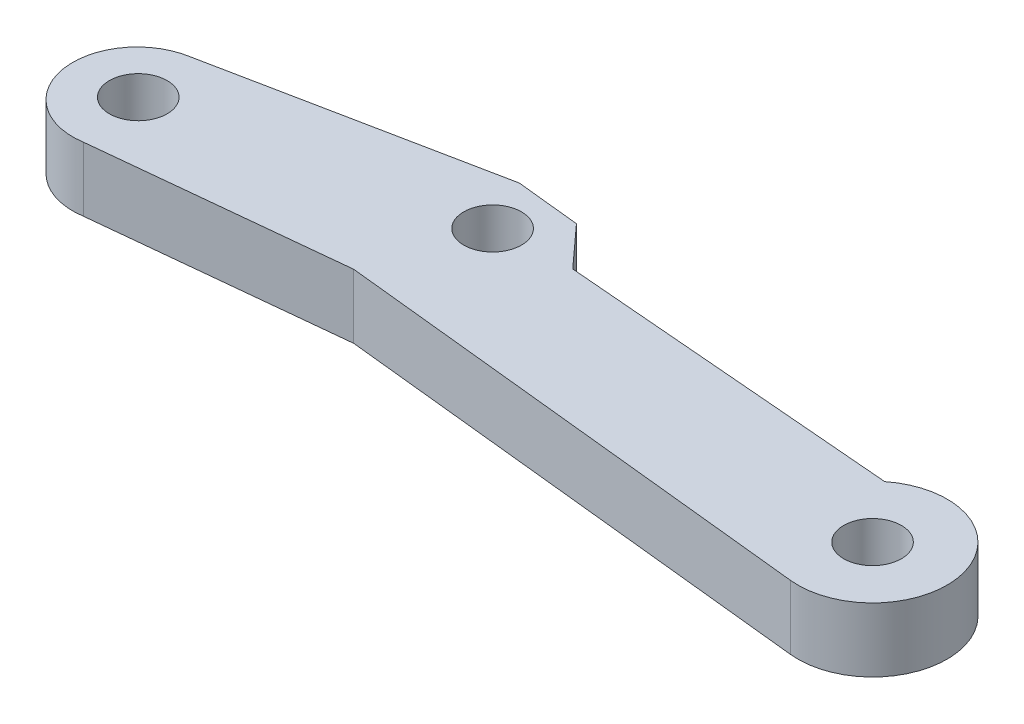
ISO-10303-21;
HEADER;
FILE_DESCRIPTION(('STEP AP214'),'2;1');
FILE_NAME('part.step','',(''),(''),'','','');
FILE_SCHEMA(('AUTOMOTIVE_DESIGN { 1 0 10303 214 1 1 1 1 }'));
ENDSEC;
DATA;
#1=APPLICATION_CONTEXT('core data for automotive mechanical design processes');
#2=APPLICATION_PROTOCOL_DEFINITION('international standard','automotive_design',2000,#1);
#3=PRODUCT_CONTEXT('',#1,'mechanical');
#4=PRODUCT('Part','Part','',(#3));
#5=PRODUCT_RELATED_PRODUCT_CATEGORY('part','',(#4));
#6=PRODUCT_DEFINITION_FORMATION('','',#4);
#7=PRODUCT_DEFINITION_CONTEXT('part definition',#1,'design');
#8=PRODUCT_DEFINITION('design','',#6,#7);
#9=PRODUCT_DEFINITION_SHAPE('','',#8);
#10=(LENGTH_UNIT() NAMED_UNIT(*) SI_UNIT(.MILLI.,.METRE.));
#11=(NAMED_UNIT(*) PLANE_ANGLE_UNIT() SI_UNIT($,.RADIAN.));
#12=(NAMED_UNIT(*) SI_UNIT($,.STERADIAN.) SOLID_ANGLE_UNIT());
#13=UNCERTAINTY_MEASURE_WITH_UNIT(LENGTH_MEASURE(1.E-05),#10,'distance_accuracy_value','');
#14=(GEOMETRIC_REPRESENTATION_CONTEXT(3) GLOBAL_UNCERTAINTY_ASSIGNED_CONTEXT((#13)) GLOBAL_UNIT_ASSIGNED_CONTEXT((#10,
#11,#12)) REPRESENTATION_CONTEXT('',''));
#15=CARTESIAN_POINT('',(0.,0.,0.));
#16=DIRECTION('',(0.,0.,1.));
#17=DIRECTION('',(1.,0.,0.));
#18=AXIS2_PLACEMENT_3D('',#15,#16,#17);
#19=CARTESIAN_POINT('',(22.2994058375288,-68.,33.5249544921954));
#20=DIRECTION('',(-0.19761330757037,0.,-0.980280052164226));
#21=DIRECTION('',(-0.980280052164226,0.,0.19761330757037));
#22=AXIS2_PLACEMENT_3D('',#19,#20,#21);
#23=PLANE('',#22);
#24=DIRECTION('',(0.980280052164226,0.,-0.19761330757037));
#25=VECTOR('',#24,1.);
#26=CARTESIAN_POINT('',(22.2994058375288,-68.,33.5249544921954));
#27=LINE('',#26,#25);
#28=CARTESIAN_POINT('',(22.2994058375288,-68.,33.5249544921954));
#29=VERTEX_POINT('',#28);
#30=CARTESIAN_POINT('',(43.6041069864173,-68.,29.2301690872132));
#31=VERTEX_POINT('',#30);
#32=EDGE_CURVE('E111',#29,#31,#27,.T.);
#33=ORIENTED_EDGE('',*,*,#32,.T.);
#34=DIRECTION('',(0.,-1.,0.));
#35=VECTOR('',#34,1.);
#36=CARTESIAN_POINT('',(43.6041069864173,-68.,29.2301690872132));
#37=LINE('',#36,#35);
#38=CARTESIAN_POINT('',(43.6041069864173,-73.,29.2301690872132));
#39=VERTEX_POINT('',#38);
#40=EDGE_CURVE('E172',#31,#39,#37,.T.);
#41=ORIENTED_EDGE('',*,*,#40,.T.);
#42=DIRECTION('',(0.980280052164226,0.,-0.19761330757037));
#43=VECTOR('',#42,1.);
#44=CARTESIAN_POINT('',(22.2994058375288,-73.,33.5249544921954));
#45=LINE('',#44,#43);
#46=CARTESIAN_POINT('',(22.2994058375288,-73.,33.5249544921954));
#47=VERTEX_POINT('',#46);
#48=EDGE_CURVE('E144',#47,#39,#45,.T.);
#49=ORIENTED_EDGE('',*,*,#48,.F.);
#50=DIRECTION('',(0.,-1.,0.));
#51=VECTOR('',#50,1.);
#52=CARTESIAN_POINT('',(22.2994058375288,-68.,33.5249544921954));
#53=LINE('',#52,#51);
#54=EDGE_CURVE('E169',#29,#47,#53,.T.);
#55=ORIENTED_EDGE('',*,*,#54,.F.);
#56=EDGE_LOOP('',(#33,#41,#49,#55));
#57=FACE_BOUND('',#56,.T.);
#58=ADVANCED_FACE('F38',(#57),#23,.T.);
#59=CARTESIAN_POINT('',(23.0883515015579,-68.,38.4893621480176));
#60=DIRECTION('',(0.,-1.,0.));
#61=DIRECTION('',(0.,0.,-1.));
#62=AXIS2_PLACEMENT_3D('',#59,#60,#61);
#63=CYLINDRICAL_SURFACE('',#62,5.02670653947264);
#64=CARTESIAN_POINT('',(23.0883515015579,-73.,38.4893621480176));
#65=DIRECTION('',(0.,-1.,0.));
#66=DIRECTION('',(0.,0.,-1.));
#67=AXIS2_PLACEMENT_3D('',#64,#65,#66);
#68=CIRCLE('',#67,5.02670653947264);
#69=CARTESIAN_POINT('',(23.8772971655872,-73.,43.4537698038399));
#70=VERTEX_POINT('',#69);
#71=EDGE_CURVE('E165',#70,#47,#68,.T.);
#72=ORIENTED_EDGE('',*,*,#71,.F.);
#73=DIRECTION('',(0.,-1.,0.));
#74=VECTOR('',#73,1.);
#75=CARTESIAN_POINT('',(23.8772971655872,-68.,43.4537698038399));
#76=LINE('',#75,#74);
#77=CARTESIAN_POINT('',(23.8772971655872,-68.,43.4537698038399));
#78=VERTEX_POINT('',#77);
#79=EDGE_CURVE('E173',#78,#70,#76,.T.);
#80=ORIENTED_EDGE('',*,*,#79,.F.);
#81=CARTESIAN_POINT('',(23.0883515015579,-68.,38.4893621480176));
#82=DIRECTION('',(0.,-1.,0.));
#83=DIRECTION('',(0.,0.,-1.));
#84=AXIS2_PLACEMENT_3D('',#81,#82,#83);
#85=CIRCLE('',#84,5.02670653947264);
#86=EDGE_CURVE('E120',#78,#29,#85,.T.);
#87=ORIENTED_EDGE('',*,*,#86,.T.);
#88=ORIENTED_EDGE('',*,*,#54,.T.);
#89=EDGE_LOOP('',(#72,#80,#87,#88));
#90=FACE_BOUND('',#89,.T.);
#91=ADVANCED_FACE('F200',(#90),#63,.T.);
#92=CARTESIAN_POINT('',(42.9663306655025,-68.,41.5017314355385));
#93=DIRECTION('',(0.10172916558817,0.,0.994812131444292));
#94=DIRECTION('',(0.994812131444292,0.,-0.10172916558817));
#95=AXIS2_PLACEMENT_3D('',#92,#93,#94);
#96=PLANE('',#95);
#97=DIRECTION('',(-0.994812131444292,0.,0.10172916558817));
#98=VECTOR('',#97,1.);
#99=CARTESIAN_POINT('',(42.9663306655025,-73.,41.5017314355385));
#100=LINE('',#99,#98);
#101=CARTESIAN_POINT('',(42.9663306655025,-73.,41.5017314355385));
#102=VERTEX_POINT('',#101);
#103=EDGE_CURVE('E161',#102,#70,#100,.T.);
#104=ORIENTED_EDGE('',*,*,#103,.F.);
#105=DIRECTION('',(0.,-1.,0.));
#106=VECTOR('',#105,1.);
#107=CARTESIAN_POINT('',(42.9663306655025,-68.,41.5017314355385));
#108=LINE('',#107,#106);
#109=CARTESIAN_POINT('',(42.9663306655025,-68.,41.5017314355385));
#110=VERTEX_POINT('',#109);
#111=EDGE_CURVE('E176',#110,#102,#108,.T.);
#112=ORIENTED_EDGE('',*,*,#111,.F.);
#113=DIRECTION('',(-0.994812131444292,0.,0.10172916558817));
#114=VECTOR('',#113,1.);
#115=CARTESIAN_POINT('',(42.9663306655025,-68.,41.5017314355385));
#116=LINE('',#115,#114);
#117=EDGE_CURVE('E137',#110,#78,#116,.T.);
#118=ORIENTED_EDGE('',*,*,#117,.T.);
#119=ORIENTED_EDGE('',*,*,#79,.T.);
#120=EDGE_LOOP('',(#104,#112,#118,#119));
#121=FACE_BOUND('',#120,.T.);
#122=ADVANCED_FACE('F243',(#121),#96,.T.);
#123=CARTESIAN_POINT('',(80.9887124146183,-68.,45.4779480814177));
#124=DIRECTION('',(-0.104008509836308,0.,0.99457640726172));
#125=DIRECTION('',(0.99457640726172,0.,0.104008509836308));
#126=AXIS2_PLACEMENT_3D('',#123,#124,#125);
#127=PLANE('',#126);
#128=DIRECTION('',(-0.99457640726172,0.,-0.104008509836308));
#129=VECTOR('',#128,1.);
#130=CARTESIAN_POINT('',(80.9887124146183,-73.,45.4779480814177));
#131=LINE('',#130,#129);
#132=CARTESIAN_POINT('',(80.9887124146183,-73.,45.4779480814177));
#133=VERTEX_POINT('',#132);
#134=EDGE_CURVE('E157',#133,#102,#131,.T.);
#135=ORIENTED_EDGE('',*,*,#134,.F.);
#136=DIRECTION('',(0.,-1.,0.));
#137=VECTOR('',#136,1.);
#138=CARTESIAN_POINT('',(80.9887124146183,-68.,45.4779480814177));
#139=LINE('',#138,#137);
#140=CARTESIAN_POINT('',(80.9887124146183,-68.,45.4779480814177));
#141=VERTEX_POINT('',#140);
#142=EDGE_CURVE('E179',#141,#133,#139,.T.);
#143=ORIENTED_EDGE('',*,*,#142,.F.);
#144=DIRECTION('',(-0.99457640726172,0.,-0.104008509836308));
#145=VECTOR('',#144,1.);
#146=CARTESIAN_POINT('',(80.9887124146183,-68.,45.4779480814177));
#147=LINE('',#146,#145);
#148=EDGE_CURVE('E130',#141,#110,#147,.T.);
#149=ORIENTED_EDGE('',*,*,#148,.T.);
#150=ORIENTED_EDGE('',*,*,#111,.T.);
#151=EDGE_LOOP('',(#135,#143,#149,#150));
#152=FACE_BOUND('',#151,.T.);
#153=ADVANCED_FACE('F253',(#152),#127,.T.);
#154=CARTESIAN_POINT('',(81.5930942183607,-68.,39.6985759519024));
#155=DIRECTION('',(0.,-1.,0.));
#156=DIRECTION('',(0.,0.,-1.));
#157=AXIS2_PLACEMENT_3D('',#154,#155,#156);
#158=CYLINDRICAL_SURFACE('',#157,5.81088801958118);
#159=CARTESIAN_POINT('',(81.5930942183607,-73.,39.6985759519024));
#160=DIRECTION('',(0.,-1.,0.));
#161=DIRECTION('',(0.,0.,1.));
#162=AXIS2_PLACEMENT_3D('',#159,#160,#161);
#163=CIRCLE('',#162,5.81088801958118);
#164=CARTESIAN_POINT('',(77.9854924947194,-73.,35.143180318185));
#165=VERTEX_POINT('',#164);
#166=EDGE_CURVE('E153',#165,#133,#163,.T.);
#167=ORIENTED_EDGE('',*,*,#166,.F.);
#168=DIRECTION('',(0.,-1.,0.));
#169=VECTOR('',#168,1.);
#170=CARTESIAN_POINT('',(77.9854924947194,-68.,35.143180318185));
#171=LINE('',#170,#169);
#172=CARTESIAN_POINT('',(77.9854924947194,-68.,35.143180318185));
#173=VERTEX_POINT('',#172);
#174=EDGE_CURVE('E119',#173,#165,#171,.T.);
#175=ORIENTED_EDGE('',*,*,#174,.F.);
#176=CARTESIAN_POINT('',(81.5930942183607,-68.,39.6985759519024));
#177=DIRECTION('',(0.,-1.,0.));
#178=DIRECTION('',(0.,0.,1.));
#179=AXIS2_PLACEMENT_3D('',#176,#177,#178);
#180=CIRCLE('',#179,5.81088801958118);
#181=EDGE_CURVE('E126',#173,#141,#180,.T.);
#182=ORIENTED_EDGE('',*,*,#181,.T.);
#183=ORIENTED_EDGE('',*,*,#142,.T.);
#184=EDGE_LOOP('',(#167,#175,#182,#183));
#185=FACE_BOUND('',#184,.T.);
#186=ADVANCED_FACE('F250',(#185),#158,.T.);
#187=CARTESIAN_POINT('',(51.4864477873886,-68.,32.9522500136108));
#188=DIRECTION('',(0.082398441042192,0.,-0.996599466643353));
#189=DIRECTION('',(-0.996599466643353,0.,-0.082398441042192));
#190=AXIS2_PLACEMENT_3D('',#187,#188,#189);
#191=PLANE('',#190);
#192=DIRECTION('',(0.996599466643353,0.,0.082398441042192));
#193=VECTOR('',#192,1.);
#194=CARTESIAN_POINT('',(51.4864477873886,-73.,32.9522500136108));
#195=LINE('',#194,#193);
#196=CARTESIAN_POINT('',(51.4864477873886,-73.,32.9522500136108));
#197=VERTEX_POINT('',#196);
#198=EDGE_CURVE('E117',#197,#165,#195,.T.);
#199=ORIENTED_EDGE('',*,*,#198,.F.);
#200=DIRECTION('',(0.,-1.,0.));
#201=VECTOR('',#200,1.);
#202=CARTESIAN_POINT('',(51.4864477873886,-68.,32.9522500136108));
#203=LINE('',#202,#201);
#204=CARTESIAN_POINT('',(51.4864477873886,-68.,32.9522500136108));
#205=VERTEX_POINT('',#204);
#206=EDGE_CURVE('E104',#205,#197,#203,.T.);
#207=ORIENTED_EDGE('',*,*,#206,.F.);
#208=DIRECTION('',(0.996599466643353,0.,0.082398441042192));
#209=VECTOR('',#208,1.);
#210=CARTESIAN_POINT('',(51.4864477873886,-68.,32.9522500136108));
#211=LINE('',#210,#209);
#212=EDGE_CURVE('E110',#205,#173,#211,.T.);
#213=ORIENTED_EDGE('',*,*,#212,.T.);
#214=ORIENTED_EDGE('',*,*,#174,.T.);
#215=EDGE_LOOP('',(#199,#207,#213,#214));
#216=FACE_BOUND('',#215,.T.);
#217=ADVANCED_FACE('F115',(#216),#191,.T.);
#218=CARTESIAN_POINT('',(47.401706558374,-68.,28.4646162122104));
#219=DIRECTION('',(0.739523736349641,0.,-0.673130480200879));
#220=DIRECTION('',(-0.673130480200879,0.,-0.739523736349641));
#221=AXIS2_PLACEMENT_3D('',#218,#219,#220);
#222=PLANE('',#221);
#223=DIRECTION('',(0.673130480200879,0.,0.739523736349641));
#224=VECTOR('',#223,1.);
#225=CARTESIAN_POINT('',(47.401706558374,-73.,28.4646162122104));
#226=LINE('',#225,#224);
#227=CARTESIAN_POINT('',(48.5713461575372,-73.,29.749621529898));
#228=VERTEX_POINT('',#227);
#229=EDGE_CURVE('E147',#228,#197,#226,.T.);
#230=ORIENTED_EDGE('',*,*,#229,.F.);
#231=DIRECTION('',(0.,1.,0.));
#232=VECTOR('',#231,1.);
#233=CARTESIAN_POINT('',(48.5713461575372,-68.,29.749621529898));
#234=LINE('',#233,#232);
#235=CARTESIAN_POINT('',(48.5713461575372,-68.,29.749621529898));
#236=VERTEX_POINT('',#235);
#237=EDGE_CURVE('E48',#228,#236,#234,.T.);
#238=ORIENTED_EDGE('',*,*,#237,.T.);
#239=DIRECTION('',(0.673130480200879,0.,0.739523736349641));
#240=VECTOR('',#239,1.);
#241=CARTESIAN_POINT('',(47.401706558374,-68.,28.4646162122104));
#242=LINE('',#241,#240);
#243=EDGE_CURVE('E101',#236,#205,#242,.T.);
#244=ORIENTED_EDGE('',*,*,#243,.T.);
#245=ORIENTED_EDGE('',*,*,#206,.T.);
#246=EDGE_LOOP('',(#230,#238,#244,#245));
#247=FACE_BOUND('',#246,.T.);
#248=ADVANCED_FACE('F103',(#247),#222,.T.);
#249=CARTESIAN_POINT('',(81.5930942183607,-68.,39.6985759519024));
#250=DIRECTION('',(0.,1.,0.));
#251=DIRECTION('',(0.,0.,1.));
#252=AXIS2_PLACEMENT_3D('',#249,#250,#251);
#253=PLANE('',#252);
#254=CARTESIAN_POINT('',(81.5930942183607,-68.,39.6985759519024));
#255=DIRECTION('',(0.,1.,0.));
#256=DIRECTION('',(0.,0.,1.));
#257=AXIS2_PLACEMENT_3D('',#254,#255,#256);
#258=CIRCLE('',#257,2.25);
#259=CARTESIAN_POINT('',(81.5930942183607,-68.,41.9485759519024));
#260=VERTEX_POINT('',#259);
#261=EDGE_CURVE('E220',#260,#260,#258,.T.);
#262=ORIENTED_EDGE('',*,*,#261,.F.);
#263=EDGE_LOOP('',(#262));
#264=FACE_BOUND('',#263,.T.);
#265=CARTESIAN_POINT('',(22.9656847085218,-68.,38.2848708650265));
#266=DIRECTION('',(0.,-1.,0.));
#267=DIRECTION('',(0.,0.,-1.));
#268=AXIS2_PLACEMENT_3D('',#265,#266,#267);
#269=CIRCLE('',#268,2.25);
#270=CARTESIAN_POINT('',(22.9656847085218,-68.,36.0348708650265));
#271=VERTEX_POINT('',#270);
#272=EDGE_CURVE('E212',#271,#271,#269,.T.);
#273=ORIENTED_EDGE('',*,*,#272,.T.);
#274=EDGE_LOOP('',(#273));
#275=FACE_BOUND('',#274,.T.);
#276=CARTESIAN_POINT('',(45.6292596156505,-68.,33.3388695196497));
#277=DIRECTION('',(0.,-1.,0.));
#278=DIRECTION('',(0.,0.,-1.));
#279=AXIS2_PLACEMENT_3D('',#276,#277,#278);
#280=CIRCLE('',#279,2.25);
#281=CARTESIAN_POINT('',(45.6292596156505,-68.,31.0888695196497));
#282=VERTEX_POINT('',#281);
#283=EDGE_CURVE('E148',#282,#282,#280,.T.);
#284=ORIENTED_EDGE('',*,*,#283,.T.);
#285=EDGE_LOOP('',(#284));
#286=FACE_BOUND('',#285,.T.);
#287=ORIENTED_EDGE('',*,*,#243,.F.);
#288=DIRECTION('',(0.99457640726172,0.,0.104008509836309));
#289=VECTOR('',#288,1.);
#290=CARTESIAN_POINT('',(82.2650362596076,-68.,33.2731622783169));
#291=LINE('',#290,#289);
#292=EDGE_CURVE('E11',#236,#31,#291,.F.);
#293=ORIENTED_EDGE('',*,*,#292,.T.);
#294=ORIENTED_EDGE('',*,*,#32,.F.);
#295=ORIENTED_EDGE('',*,*,#86,.F.);
#296=ORIENTED_EDGE('',*,*,#117,.F.);
#297=ORIENTED_EDGE('',*,*,#148,.F.);
#298=ORIENTED_EDGE('',*,*,#181,.F.);
#299=ORIENTED_EDGE('',*,*,#212,.F.);
#300=EDGE_LOOP('',(#287,#293,#294,#295,#296,#297,#298,#299));
#301=FACE_BOUND('',#300,.T.);
#302=ADVANCED_FACE('F123',(#264,#275,#286,#301),#253,.T.);
#303=CARTESIAN_POINT('',(81.5930942183607,-73.,39.6985759519024));
#304=DIRECTION('',(0.,1.,0.));
#305=DIRECTION('',(0.,0.,1.));
#306=AXIS2_PLACEMENT_3D('',#303,#304,#305);
#307=PLANE('',#306);
#308=CARTESIAN_POINT('',(81.5930942183607,-73.,39.6985759519024));
#309=DIRECTION('',(0.,1.,0.));
#310=DIRECTION('',(0.,0.,1.));
#311=AXIS2_PLACEMENT_3D('',#308,#309,#310);
#312=CIRCLE('',#311,2.25);
#313=CARTESIAN_POINT('',(81.5930942183607,-73.,41.9485759519024));
#314=VERTEX_POINT('',#313);
#315=EDGE_CURVE('E42',#314,#314,#312,.T.);
#316=ORIENTED_EDGE('',*,*,#315,.T.);
#317=EDGE_LOOP('',(#316));
#318=FACE_BOUND('',#317,.T.);
#319=CARTESIAN_POINT('',(22.9656847085218,-73.,38.2848708650265));
#320=DIRECTION('',(0.,-1.,0.));
#321=DIRECTION('',(0.,0.,-1.));
#322=AXIS2_PLACEMENT_3D('',#319,#320,#321);
#323=CIRCLE('',#322,2.25);
#324=CARTESIAN_POINT('',(22.9656847085218,-73.,36.0348708650265));
#325=VERTEX_POINT('',#324);
#326=EDGE_CURVE('E216',#325,#325,#323,.T.);
#327=ORIENTED_EDGE('',*,*,#326,.F.);
#328=EDGE_LOOP('',(#327));
#329=FACE_BOUND('',#328,.T.);
#330=CARTESIAN_POINT('',(45.6292596156505,-73.,33.3388695196497));
#331=DIRECTION('',(0.,-1.,0.));
#332=DIRECTION('',(0.,0.,-1.));
#333=AXIS2_PLACEMENT_3D('',#330,#331,#332);
#334=CIRCLE('',#333,2.25);
#335=CARTESIAN_POINT('',(45.6292596156505,-73.,31.0888695196497));
#336=VERTEX_POINT('',#335);
#337=EDGE_CURVE('E208',#336,#336,#334,.T.);
#338=ORIENTED_EDGE('',*,*,#337,.F.);
#339=EDGE_LOOP('',(#338));
#340=FACE_BOUND('',#339,.T.);
#341=ORIENTED_EDGE('',*,*,#48,.T.);
#342=DIRECTION('',(-0.99457640726172,0.,-0.104008509836309));
#343=VECTOR('',#342,1.);
#344=CARTESIAN_POINT('',(43.6041069864173,-73.,29.2301690872132));
#345=LINE('',#344,#343);
#346=EDGE_CURVE('E62',#39,#228,#345,.F.);
#347=ORIENTED_EDGE('',*,*,#346,.T.);
#348=ORIENTED_EDGE('',*,*,#229,.T.);
#349=ORIENTED_EDGE('',*,*,#198,.T.);
#350=ORIENTED_EDGE('',*,*,#166,.T.);
#351=ORIENTED_EDGE('',*,*,#134,.T.);
#352=ORIENTED_EDGE('',*,*,#103,.T.);
#353=ORIENTED_EDGE('',*,*,#71,.T.);
#354=EDGE_LOOP('',(#341,#347,#348,#349,#350,#351,#352,#353));
#355=FACE_BOUND('',#354,.T.);
#356=ADVANCED_FACE('F196',(#318,#329,#340,#355),#307,.F.);
#357=CARTESIAN_POINT('',(45.6292596156505,-73.,33.3388695196497));
#358=DIRECTION('',(0.,-1.,0.));
#359=DIRECTION('',(0.,0.,-1.));
#360=AXIS2_PLACEMENT_3D('',#357,#358,#359);
#361=CYLINDRICAL_SURFACE('',#360,2.25);
#362=ORIENTED_EDGE('',*,*,#283,.F.);
#363=EDGE_LOOP('',(#362));
#364=FACE_BOUND('',#363,.T.);
#365=ORIENTED_EDGE('',*,*,#337,.T.);
#366=EDGE_LOOP('',(#365));
#367=FACE_BOUND('',#366,.T.);
#368=ADVANCED_FACE('F263',(#364,#367),#361,.F.);
#369=CARTESIAN_POINT('',(22.9656847085218,-73.,38.2848708650265));
#370=DIRECTION('',(0.,-1.,0.));
#371=DIRECTION('',(0.,0.,-1.));
#372=AXIS2_PLACEMENT_3D('',#369,#370,#371);
#373=CYLINDRICAL_SURFACE('',#372,2.25);
#374=ORIENTED_EDGE('',*,*,#272,.F.);
#375=EDGE_LOOP('',(#374));
#376=FACE_BOUND('',#375,.T.);
#377=ORIENTED_EDGE('',*,*,#326,.T.);
#378=EDGE_LOOP('',(#377));
#379=FACE_BOUND('',#378,.T.);
#380=ADVANCED_FACE('F237',(#376,#379),#373,.F.);
#381=CARTESIAN_POINT('',(43.6041069864173,-68.,29.2301690872132));
#382=DIRECTION('',(-0.104008509836309,0.,0.99457640726172));
#383=DIRECTION('',(0.,-1.,0.));
#384=AXIS2_PLACEMENT_3D('',#381,#382,#383);
#385=PLANE('',#384);
#386=ORIENTED_EDGE('',*,*,#292,.F.);
#387=ORIENTED_EDGE('',*,*,#237,.F.);
#388=ORIENTED_EDGE('',*,*,#346,.F.);
#389=ORIENTED_EDGE('',*,*,#40,.F.);
#390=EDGE_LOOP('',(#386,#387,#388,#389));
#391=FACE_BOUND('',#390,.T.);
#392=ADVANCED_FACE('F40',(#391),#385,.F.);
#393=CARTESIAN_POINT('',(81.5930942183607,-78.,39.6985759519024));
#394=DIRECTION('',(0.,1.,0.));
#395=DIRECTION('',(0.,0.,1.));
#396=AXIS2_PLACEMENT_3D('',#393,#394,#395);
#397=CYLINDRICAL_SURFACE('',#396,2.25);
#398=ORIENTED_EDGE('',*,*,#261,.T.);
#399=EDGE_LOOP('',(#398));
#400=FACE_BOUND('',#399,.T.);
#401=ORIENTED_EDGE('',*,*,#315,.F.);
#402=EDGE_LOOP('',(#401));
#403=FACE_BOUND('',#402,.T.);
#404=ADVANCED_FACE('F231',(#400,#403),#397,.F.);
#405=CLOSED_SHELL('',(#58,#91,#122,#153,#186,#217,#248,#302,#356,#368,#380,#392,#404));
#406=MANIFOLD_SOLID_BREP('B2',#405);
#407=ADVANCED_BREP_SHAPE_REPRESENTATION('',(#18,#406),#14);
#408=SHAPE_DEFINITION_REPRESENTATION(#9,#407);
ENDSEC;
END-ISO-10303-21;
